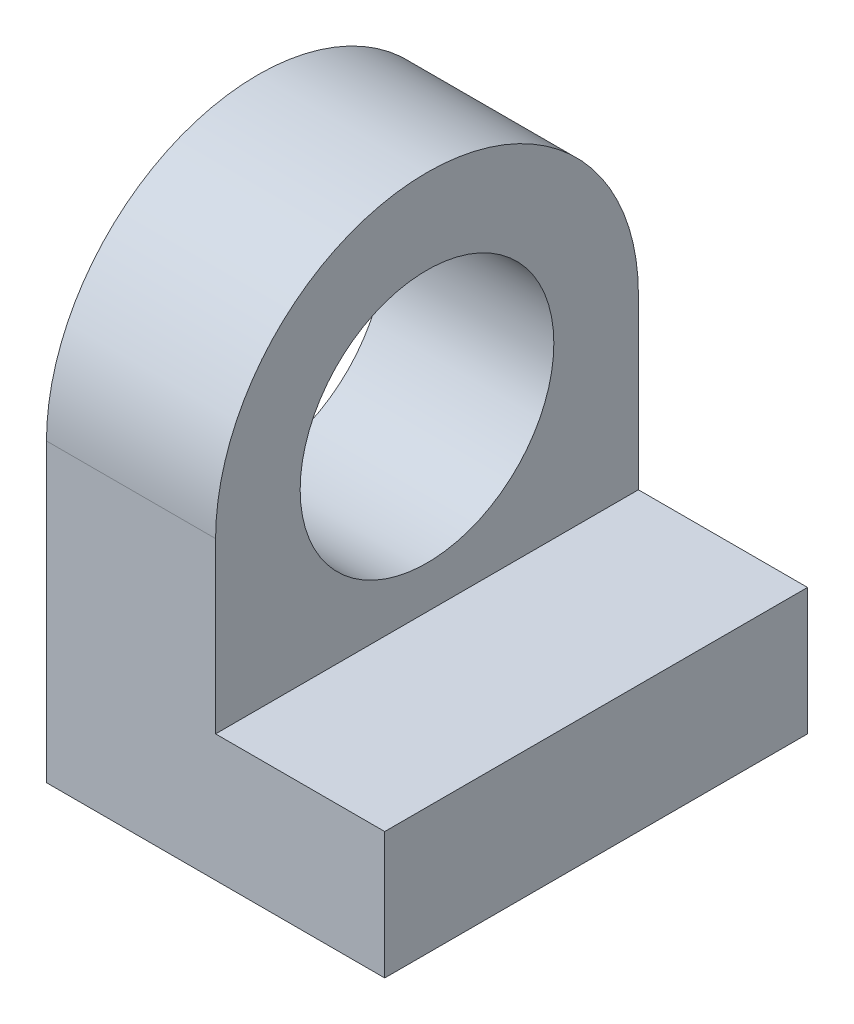
ISO-10303-21;
HEADER;
FILE_DESCRIPTION(('STEP AP214'),'2;1');
FILE_NAME('part.step','',(''),(''),'','','');
FILE_SCHEMA(('AUTOMOTIVE_DESIGN { 1 0 10303 214 1 1 1 1 }'));
ENDSEC;
DATA;
#1=APPLICATION_CONTEXT('core data for automotive mechanical design processes');
#2=APPLICATION_PROTOCOL_DEFINITION('international standard','automotive_design',2000,#1);
#3=PRODUCT_CONTEXT('',#1,'mechanical');
#4=PRODUCT('Part','Part','',(#3));
#5=PRODUCT_RELATED_PRODUCT_CATEGORY('part','',(#4));
#6=PRODUCT_DEFINITION_FORMATION('','',#4);
#7=PRODUCT_DEFINITION_CONTEXT('part definition',#1,'design');
#8=PRODUCT_DEFINITION('design','',#6,#7);
#9=PRODUCT_DEFINITION_SHAPE('','',#8);
#10=(LENGTH_UNIT() NAMED_UNIT(*) SI_UNIT(.MILLI.,.METRE.));
#11=(NAMED_UNIT(*) PLANE_ANGLE_UNIT() SI_UNIT($,.RADIAN.));
#12=(NAMED_UNIT(*) SI_UNIT($,.STERADIAN.) SOLID_ANGLE_UNIT());
#13=UNCERTAINTY_MEASURE_WITH_UNIT(LENGTH_MEASURE(1.E-05),#10,'distance_accuracy_value','');
#14=(GEOMETRIC_REPRESENTATION_CONTEXT(3) GLOBAL_UNCERTAINTY_ASSIGNED_CONTEXT((#13)) GLOBAL_UNIT_ASSIGNED_CONTEXT((#10,
#11,#12)) REPRESENTATION_CONTEXT('',''));
#15=CARTESIAN_POINT('',(0.,0.,0.));
#16=DIRECTION('',(0.,0.,1.));
#17=DIRECTION('',(1.,0.,0.));
#18=AXIS2_PLACEMENT_3D('',#15,#16,#17);
#19=CARTESIAN_POINT('',(-20.,0.,0.));
#20=DIRECTION('',(0.,0.,1.));
#21=DIRECTION('',(1.,0.,0.));
#22=AXIS2_PLACEMENT_3D('',#19,#20,#21);
#23=PLANE('',#22);
#24=DIRECTION('',(0.,-1.,0.));
#25=VECTOR('',#24,1.);
#26=CARTESIAN_POINT('',(-10.,7.5,0.));
#27=LINE('',#26,#25);
#28=CARTESIAN_POINT('',(-10.,17.5,0.));
#29=VERTEX_POINT('',#28);
#30=CARTESIAN_POINT('',(-10.,7.5,0.));
#31=VERTEX_POINT('',#30);
#32=EDGE_CURVE('E101',#29,#31,#27,.T.);
#33=ORIENTED_EDGE('',*,*,#32,.F.);
#34=DIRECTION('',(1.,0.,0.));
#35=VECTOR('',#34,1.);
#36=CARTESIAN_POINT('',(-20.,17.5,0.));
#37=LINE('',#36,#35);
#38=CARTESIAN_POINT('',(-20.,17.5,0.));
#39=VERTEX_POINT('',#38);
#40=EDGE_CURVE('E11',#39,#29,#37,.T.);
#41=ORIENTED_EDGE('',*,*,#40,.F.);
#42=DIRECTION('',(0.,-1.,0.));
#43=VECTOR('',#42,1.);
#44=CARTESIAN_POINT('',(-20.,0.,0.));
#45=LINE('',#44,#43);
#46=CARTESIAN_POINT('',(-20.,0.,0.));
#47=VERTEX_POINT('',#46);
#48=EDGE_CURVE('E120',#39,#47,#45,.T.);
#49=ORIENTED_EDGE('',*,*,#48,.T.);
#50=DIRECTION('',(1.,0.,0.));
#51=VECTOR('',#50,1.);
#52=CARTESIAN_POINT('',(-20.,0.,0.));
#53=LINE('',#52,#51);
#54=CARTESIAN_POINT('',(0.,0.,0.));
#55=VERTEX_POINT('',#54);
#56=EDGE_CURVE('E36',#47,#55,#53,.T.);
#57=ORIENTED_EDGE('',*,*,#56,.T.);
#58=DIRECTION('',(0.,-1.,0.));
#59=VECTOR('',#58,1.);
#60=CARTESIAN_POINT('',(0.,0.,0.));
#61=LINE('',#60,#59);
#62=CARTESIAN_POINT('',(0.,7.5,0.));
#63=VERTEX_POINT('',#62);
#64=EDGE_CURVE('E107',#63,#55,#61,.T.);
#65=ORIENTED_EDGE('',*,*,#64,.F.);
#66=DIRECTION('',(1.,0.,0.));
#67=VECTOR('',#66,1.);
#68=CARTESIAN_POINT('',(0.,7.5,0.));
#69=LINE('',#68,#67);
#70=EDGE_CURVE('E49',#31,#63,#69,.T.);
#71=ORIENTED_EDGE('',*,*,#70,.F.);
#72=EDGE_LOOP('',(#33,#41,#49,#57,#65,#71));
#73=FACE_BOUND('',#72,.T.);
#74=ADVANCED_FACE('F33',(#73),#23,.T.);
#75=CARTESIAN_POINT('',(-20.,17.5,-12.5));
#76=DIRECTION('',(1.,0.,0.));
#77=DIRECTION('',(0.,0.,-1.));
#78=AXIS2_PLACEMENT_3D('',#75,#76,#77);
#79=CYLINDRICAL_SURFACE('',#78,12.5);
#80=CARTESIAN_POINT('',(-10.,17.5,-12.5));
#81=DIRECTION('',(-1.,0.,0.));
#82=DIRECTION('',(0.,0.,1.));
#83=AXIS2_PLACEMENT_3D('',#80,#81,#82);
#84=CIRCLE('',#83,12.5);
#85=CARTESIAN_POINT('',(-10.,17.5,-25.));
#86=VERTEX_POINT('',#85);
#87=EDGE_CURVE('E104',#29,#86,#84,.T.);
#88=ORIENTED_EDGE('',*,*,#87,.T.);
#89=DIRECTION('',(1.,0.,0.));
#90=VECTOR('',#89,1.);
#91=CARTESIAN_POINT('',(-20.,17.5,-25.));
#92=LINE('',#91,#90);
#93=CARTESIAN_POINT('',(-20.,17.5,-25.));
#94=VERTEX_POINT('',#93);
#95=EDGE_CURVE('E41',#94,#86,#92,.T.);
#96=ORIENTED_EDGE('',*,*,#95,.F.);
#97=CARTESIAN_POINT('',(-20.,17.5,-12.5));
#98=DIRECTION('',(1.,0.,0.));
#99=DIRECTION('',(0.,0.,-1.));
#100=AXIS2_PLACEMENT_3D('',#97,#98,#99);
#101=CIRCLE('',#100,12.5);
#102=EDGE_CURVE('E128',#94,#39,#101,.T.);
#103=ORIENTED_EDGE('',*,*,#102,.T.);
#104=ORIENTED_EDGE('',*,*,#40,.T.);
#105=EDGE_LOOP('',(#88,#96,#103,#104));
#106=FACE_BOUND('',#105,.T.);
#107=ADVANCED_FACE('F145',(#106),#79,.T.);
#108=CARTESIAN_POINT('',(-20.,0.,-25.));
#109=DIRECTION('',(0.,0.,-1.));
#110=DIRECTION('',(-1.,0.,0.));
#111=AXIS2_PLACEMENT_3D('',#108,#109,#110);
#112=PLANE('',#111);
#113=DIRECTION('',(0.,-1.,0.));
#114=VECTOR('',#113,1.);
#115=CARTESIAN_POINT('',(-10.,7.5,-25.));
#116=LINE('',#115,#114);
#117=CARTESIAN_POINT('',(-10.,7.5,-25.));
#118=VERTEX_POINT('',#117);
#119=EDGE_CURVE('E115',#86,#118,#116,.T.);
#120=ORIENTED_EDGE('',*,*,#119,.T.);
#121=DIRECTION('',(1.,0.,0.));
#122=VECTOR('',#121,1.);
#123=CARTESIAN_POINT('',(0.,7.5,-25.));
#124=LINE('',#123,#122);
#125=CARTESIAN_POINT('',(0.,7.5,-25.));
#126=VERTEX_POINT('',#125);
#127=EDGE_CURVE('E96',#118,#126,#124,.T.);
#128=ORIENTED_EDGE('',*,*,#127,.T.);
#129=DIRECTION('',(0.,1.,0.));
#130=VECTOR('',#129,1.);
#131=CARTESIAN_POINT('',(0.,0.,-25.));
#132=LINE('',#131,#130);
#133=CARTESIAN_POINT('',(0.,0.,-25.));
#134=VERTEX_POINT('',#133);
#135=EDGE_CURVE('E123',#134,#126,#132,.T.);
#136=ORIENTED_EDGE('',*,*,#135,.F.);
#137=DIRECTION('',(1.,0.,0.));
#138=VECTOR('',#137,1.);
#139=CARTESIAN_POINT('',(-20.,0.,-25.));
#140=LINE('',#139,#138);
#141=CARTESIAN_POINT('',(-20.,0.,-25.));
#142=VERTEX_POINT('',#141);
#143=EDGE_CURVE('E73',#142,#134,#140,.T.);
#144=ORIENTED_EDGE('',*,*,#143,.F.);
#145=DIRECTION('',(0.,1.,0.));
#146=VECTOR('',#145,1.);
#147=CARTESIAN_POINT('',(-20.,0.,-25.));
#148=LINE('',#147,#146);
#149=EDGE_CURVE('E125',#142,#94,#148,.T.);
#150=ORIENTED_EDGE('',*,*,#149,.T.);
#151=ORIENTED_EDGE('',*,*,#95,.T.);
#152=EDGE_LOOP('',(#120,#128,#136,#144,#150,#151));
#153=FACE_BOUND('',#152,.T.);
#154=ADVANCED_FACE('F142',(#153),#112,.T.);
#155=CARTESIAN_POINT('',(-20.,0.,0.));
#156=DIRECTION('',(0.,-1.,0.));
#157=DIRECTION('',(0.,0.,-1.));
#158=AXIS2_PLACEMENT_3D('',#155,#156,#157);
#159=PLANE('',#158);
#160=DIRECTION('',(0.,0.,-1.));
#161=VECTOR('',#160,1.);
#162=CARTESIAN_POINT('',(0.,0.,0.));
#163=LINE('',#162,#161);
#164=EDGE_CURVE('E132',#55,#134,#163,.T.);
#165=ORIENTED_EDGE('',*,*,#164,.F.);
#166=ORIENTED_EDGE('',*,*,#56,.F.);
#167=DIRECTION('',(0.,0.,-1.));
#168=VECTOR('',#167,1.);
#169=CARTESIAN_POINT('',(-20.,0.,0.));
#170=LINE('',#169,#168);
#171=EDGE_CURVE('E122',#47,#142,#170,.T.);
#172=ORIENTED_EDGE('',*,*,#171,.T.);
#173=ORIENTED_EDGE('',*,*,#143,.T.);
#174=EDGE_LOOP('',(#165,#166,#172,#173));
#175=FACE_BOUND('',#174,.T.);
#176=ADVANCED_FACE('F138',(#175),#159,.T.);
#177=CARTESIAN_POINT('',(-20.,17.5,-12.5));
#178=DIRECTION('',(1.,0.,0.));
#179=DIRECTION('',(0.,0.,-1.));
#180=AXIS2_PLACEMENT_3D('',#177,#178,#179);
#181=PLANE('',#180);
#182=CARTESIAN_POINT('',(-20.,17.5,-12.5));
#183=DIRECTION('',(1.,0.,0.));
#184=DIRECTION('',(0.,0.,-1.));
#185=AXIS2_PLACEMENT_3D('',#182,#183,#184);
#186=CIRCLE('',#185,7.5);
#187=CARTESIAN_POINT('',(-20.,17.5,-20.));
#188=VERTEX_POINT('',#187);
#189=EDGE_CURVE('E117',#188,#188,#186,.T.);
#190=ORIENTED_EDGE('',*,*,#189,.T.);
#191=EDGE_LOOP('',(#190));
#192=FACE_BOUND('',#191,.T.);
#193=ORIENTED_EDGE('',*,*,#48,.F.);
#194=ORIENTED_EDGE('',*,*,#102,.F.);
#195=ORIENTED_EDGE('',*,*,#149,.F.);
#196=ORIENTED_EDGE('',*,*,#171,.F.);
#197=EDGE_LOOP('',(#193,#194,#195,#196));
#198=FACE_BOUND('',#197,.T.);
#199=ADVANCED_FACE('F149',(#192,#198),#181,.F.);
#200=CARTESIAN_POINT('',(0.,17.5,-12.5));
#201=DIRECTION('',(1.,0.,0.));
#202=DIRECTION('',(0.,0.,-1.));
#203=AXIS2_PLACEMENT_3D('',#200,#201,#202);
#204=PLANE('',#203);
#205=DIRECTION('',(0.,0.,1.));
#206=VECTOR('',#205,1.);
#207=CARTESIAN_POINT('',(0.,7.5,-25.001));
#208=LINE('',#207,#206);
#209=EDGE_CURVE('E99',#126,#63,#208,.T.);
#210=ORIENTED_EDGE('',*,*,#209,.T.);
#211=ORIENTED_EDGE('',*,*,#64,.T.);
#212=ORIENTED_EDGE('',*,*,#164,.T.);
#213=ORIENTED_EDGE('',*,*,#135,.T.);
#214=EDGE_LOOP('',(#210,#211,#212,#213));
#215=FACE_BOUND('',#214,.T.);
#216=ADVANCED_FACE('F140',(#215),#204,.T.);
#217=CARTESIAN_POINT('',(-20.,17.5,-12.5));
#218=DIRECTION('',(1.,0.,0.));
#219=DIRECTION('',(0.,0.,-1.));
#220=AXIS2_PLACEMENT_3D('',#217,#218,#219);
#221=CYLINDRICAL_SURFACE('',#220,7.5);
#222=CARTESIAN_POINT('',(-10.,17.5,-12.5));
#223=DIRECTION('',(-1.,0.,0.));
#224=DIRECTION('',(0.,0.,1.));
#225=AXIS2_PLACEMENT_3D('',#222,#223,#224);
#226=CIRCLE('',#225,7.5);
#227=CARTESIAN_POINT('',(-10.,17.5,-5.));
#228=VERTEX_POINT('',#227);
#229=EDGE_CURVE('E111',#228,#228,#226,.T.);
#230=ORIENTED_EDGE('',*,*,#229,.F.);
#231=EDGE_LOOP('',(#230));
#232=FACE_BOUND('',#231,.T.);
#233=ORIENTED_EDGE('',*,*,#189,.F.);
#234=EDGE_LOOP('',(#233));
#235=FACE_BOUND('',#234,.T.);
#236=ADVANCED_FACE('F157',(#232,#235),#221,.F.);
#237=CARTESIAN_POINT('',(-10.,7.5,-25.001));
#238=DIRECTION('',(-1.,0.,0.));
#239=DIRECTION('',(0.,0.,1.));
#240=AXIS2_PLACEMENT_3D('',#237,#238,#239);
#241=PLANE('',#240);
#242=ORIENTED_EDGE('',*,*,#229,.T.);
#243=EDGE_LOOP('',(#242));
#244=FACE_BOUND('',#243,.T.);
#245=ORIENTED_EDGE('',*,*,#32,.T.);
#246=DIRECTION('',(0.,0.,1.));
#247=VECTOR('',#246,1.);
#248=CARTESIAN_POINT('',(-10.,7.5,-25.001));
#249=LINE('',#248,#247);
#250=EDGE_CURVE('E92',#118,#31,#249,.T.);
#251=ORIENTED_EDGE('',*,*,#250,.F.);
#252=ORIENTED_EDGE('',*,*,#119,.F.);
#253=ORIENTED_EDGE('',*,*,#87,.F.);
#254=EDGE_LOOP('',(#245,#251,#252,#253));
#255=FACE_BOUND('',#254,.T.);
#256=ADVANCED_FACE('F102',(#244,#255),#241,.F.);
#257=CARTESIAN_POINT('',(0.,7.5,-25.001));
#258=DIRECTION('',(0.,-1.,0.));
#259=DIRECTION('',(1.,0.,0.));
#260=AXIS2_PLACEMENT_3D('',#257,#258,#259);
#261=PLANE('',#260);
#262=ORIENTED_EDGE('',*,*,#250,.T.);
#263=ORIENTED_EDGE('',*,*,#70,.T.);
#264=ORIENTED_EDGE('',*,*,#209,.F.);
#265=ORIENTED_EDGE('',*,*,#127,.F.);
#266=EDGE_LOOP('',(#262,#263,#264,#265));
#267=FACE_BOUND('',#266,.T.);
#268=ADVANCED_FACE('F94',(#267),#261,.F.);
#269=CLOSED_SHELL('',(#74,#107,#154,#176,#199,#216,#236,#256,#268));
#270=MANIFOLD_SOLID_BREP('B2',#269);
#271=ADVANCED_BREP_SHAPE_REPRESENTATION('',(#18,#270),#14);
#272=SHAPE_DEFINITION_REPRESENTATION(#9,#271);
ENDSEC;
END-ISO-10303-21;
